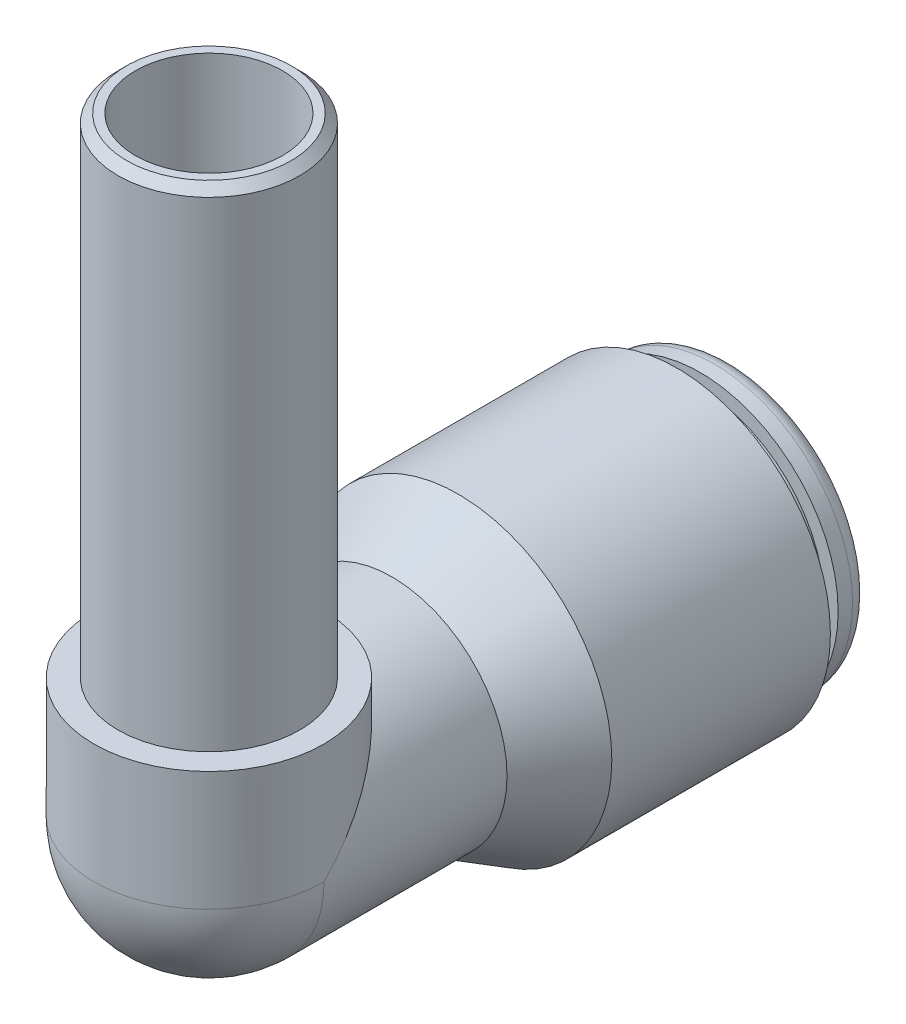
ISO-10303-21;
HEADER;
FILE_DESCRIPTION(('STEP AP214'),'2;1');
FILE_NAME('part.step','',(''),(''),'','','');
FILE_SCHEMA(('AUTOMOTIVE_DESIGN { 1 0 10303 214 1 1 1 1 }'));
ENDSEC;
DATA;
#1=APPLICATION_CONTEXT('core data for automotive mechanical design processes');
#2=APPLICATION_PROTOCOL_DEFINITION('international standard','automotive_design',2000,#1);
#3=PRODUCT_CONTEXT('',#1,'mechanical');
#4=PRODUCT('Part','Part','',(#3));
#5=PRODUCT_RELATED_PRODUCT_CATEGORY('part','',(#4));
#6=PRODUCT_DEFINITION_FORMATION('','',#4);
#7=PRODUCT_DEFINITION_CONTEXT('part definition',#1,'design');
#8=PRODUCT_DEFINITION('design','',#6,#7);
#9=PRODUCT_DEFINITION_SHAPE('','',#8);
#10=(LENGTH_UNIT() NAMED_UNIT(*) SI_UNIT(.MILLI.,.METRE.));
#11=(NAMED_UNIT(*) PLANE_ANGLE_UNIT() SI_UNIT($,.RADIAN.));
#12=(NAMED_UNIT(*) SI_UNIT($,.STERADIAN.) SOLID_ANGLE_UNIT());
#13=UNCERTAINTY_MEASURE_WITH_UNIT(LENGTH_MEASURE(1.E-05),#10,'distance_accuracy_value','');
#14=(GEOMETRIC_REPRESENTATION_CONTEXT(3) GLOBAL_UNCERTAINTY_ASSIGNED_CONTEXT((#13)) GLOBAL_UNIT_ASSIGNED_CONTEXT((#10,
#11,#12)) REPRESENTATION_CONTEXT('',''));
#15=CARTESIAN_POINT('',(0.,0.,0.));
#16=DIRECTION('',(0.,0.,1.));
#17=DIRECTION('',(1.,0.,0.));
#18=AXIS2_PLACEMENT_3D('',#15,#16,#17);
#19=CARTESIAN_POINT('',(0.,5.25,0.));
#20=DIRECTION('',(0.,1.,0.));
#21=DIRECTION('',(0.,0.,1.));
#22=AXIS2_PLACEMENT_3D('',#19,#20,#21);
#23=PLANE('',#22);
#24=CARTESIAN_POINT('',(0.,5.25,0.));
#25=DIRECTION('',(0.,1.,0.));
#26=DIRECTION('',(0.,0.,1.));
#27=AXIS2_PLACEMENT_3D('',#24,#25,#26);
#28=CIRCLE('',#27,5.0625);
#29=CARTESIAN_POINT('',(0.,5.25000000000002,5.06249999999998));
#30=VERTEX_POINT('',#29);
#31=EDGE_CURVE('E106',#30,#30,#28,.T.);
#32=ORIENTED_EDGE('',*,*,#31,.T.);
#33=EDGE_LOOP('',(#32));
#34=FACE_BOUND('',#33,.T.);
#35=CARTESIAN_POINT('',(0.,5.25,0.));
#36=DIRECTION('',(0.,1.,0.));
#37=DIRECTION('',(0.,0.,1.));
#38=AXIS2_PLACEMENT_3D('',#35,#36,#37);
#39=CIRCLE('',#38,4.);
#40=CARTESIAN_POINT('',(0.,5.25000000000001,3.99999999999998));
#41=VERTEX_POINT('',#40);
#42=EDGE_CURVE('E79',#41,#41,#39,.T.);
#43=ORIENTED_EDGE('',*,*,#42,.F.);
#44=EDGE_LOOP('',(#43));
#45=FACE_BOUND('',#44,.T.);
#46=ADVANCED_FACE('F43',(#34,#45),#23,.T.);
#47=CARTESIAN_POINT('',(0.,5.25,0.));
#48=DIRECTION('',(0.,-1.,0.));
#49=DIRECTION('',(0.,0.,-1.));
#50=AXIS2_PLACEMENT_3D('',#47,#48,#49);
#51=CYLINDRICAL_SURFACE('',#50,3.238);
#52=CARTESIAN_POINT('',(0.,0.,0.));
#53=DIRECTION('',(0.,-0.707106781186549,-0.707106781186546));
#54=DIRECTION('',(0.,-0.707106781186546,0.707106781186549));
#55=AXIS2_PLACEMENT_3D('',#52,#53,#54);
#56=ELLIPSE('',#55,4.57922351496409,3.238);
#57=CARTESIAN_POINT('',(3.238,0.,0.));
#58=VERTEX_POINT('',#57);
#59=CARTESIAN_POINT('',(-3.238,0.,0.));
#60=VERTEX_POINT('',#59);
#61=EDGE_CURVE('E70',#58,#60,#56,.F.);
#62=ORIENTED_EDGE('',*,*,#61,.F.);
#63=CARTESIAN_POINT('',(0.,0.,0.));
#64=DIRECTION('',(0.,-1.,0.));
#65=DIRECTION('',(1.,0.,0.));
#66=AXIS2_PLACEMENT_3D('',#63,#64,#65);
#67=CIRCLE('',#66,3.238);
#68=EDGE_CURVE('E75',#58,#60,#67,.T.);
#69=ORIENTED_EDGE('',*,*,#68,.T.);
#70=EDGE_LOOP('',(#62,#69));
#71=FACE_BOUND('',#70,.T.);
#72=CARTESIAN_POINT('',(0.,26.75,0.));
#73=DIRECTION('',(0.,1.,0.));
#74=DIRECTION('',(0.,0.,1.));
#75=AXIS2_PLACEMENT_3D('',#72,#73,#74);
#76=CIRCLE('',#75,3.238);
#77=CARTESIAN_POINT('',(0.,26.75,3.23799999999991));
#78=VERTEX_POINT('',#77);
#79=EDGE_CURVE('E169',#78,#78,#76,.T.);
#80=ORIENTED_EDGE('',*,*,#79,.T.);
#81=EDGE_LOOP('',(#80));
#82=FACE_BOUND('',#81,.T.);
#83=ADVANCED_FACE('F72',(#71,#82),#51,.F.);
#84=CARTESIAN_POINT('',(0.,0.,0.));
#85=DIRECTION('',(0.,0.,1.));
#86=DIRECTION('',(1.,0.,0.));
#87=AXIS2_PLACEMENT_3D('',#84,#85,#86);
#88=CYLINDRICAL_SURFACE('',#87,4.);
#89=CARTESIAN_POINT('',(0.,0.,-22.619));
#90=DIRECTION('',(0.,0.,1.));
#91=DIRECTION('',(1.,0.,0.));
#92=AXIS2_PLACEMENT_3D('',#89,#90,#91);
#93=CIRCLE('',#92,4.);
#94=CARTESIAN_POINT('',(4.,0.,-22.619));
#95=VERTEX_POINT('',#94);
#96=EDGE_CURVE('E95',#95,#95,#93,.T.);
#97=ORIENTED_EDGE('',*,*,#96,.F.);
#98=EDGE_LOOP('',(#97));
#99=FACE_BOUND('',#98,.T.);
#100=CARTESIAN_POINT('',(0.,0.,-5.0625));
#101=DIRECTION('',(0.,0.,1.));
#102=DIRECTION('',(1.,0.,0.));
#103=AXIS2_PLACEMENT_3D('',#100,#101,#102);
#104=CIRCLE('',#103,4.);
#105=CARTESIAN_POINT('',(4.,0.,-5.0625));
#106=VERTEX_POINT('',#105);
#107=EDGE_CURVE('E112',#106,#106,#104,.F.);
#108=ORIENTED_EDGE('',*,*,#107,.F.);
#109=EDGE_LOOP('',(#108));
#110=FACE_BOUND('',#109,.T.);
#111=ADVANCED_FACE('F186',(#99,#110),#88,.F.);
#112=CARTESIAN_POINT('',(0.,0.,0.));
#113=DIRECTION('',(0.,0.,1.));
#114=DIRECTION('',(1.,0.,0.));
#115=AXIS2_PLACEMENT_3D('',#112,#113,#114);
#116=CYLINDRICAL_SURFACE('',#115,5.0625);
#117=CARTESIAN_POINT('',(0.,0.,0.));
#118=DIRECTION('',(0.,0.,1.));
#119=DIRECTION('',(1.,0.,0.));
#120=AXIS2_PLACEMENT_3D('',#117,#118,#119);
#121=CIRCLE('',#120,5.0625);
#122=CARTESIAN_POINT('',(-5.0625,0.,0.));
#123=VERTEX_POINT('',#122);
#124=CARTESIAN_POINT('',(5.0625,0.,0.));
#125=VERTEX_POINT('',#124);
#126=EDGE_CURVE('E58',#123,#125,#121,.T.);
#127=ORIENTED_EDGE('',*,*,#126,.F.);
#128=CARTESIAN_POINT('',(0.,0.,0.));
#129=DIRECTION('',(0.,0.707106781186549,0.707106781186546));
#130=DIRECTION('',(0.,-0.707106781186546,0.707106781186549));
#131=AXIS2_PLACEMENT_3D('',#128,#129,#130);
#132=ELLIPSE('',#131,7.1594561595138,5.0625);
#133=EDGE_CURVE('E62',#123,#125,#132,.F.);
#134=ORIENTED_EDGE('',*,*,#133,.T.);
#135=EDGE_LOOP('',(#127,#134));
#136=FACE_BOUND('',#135,.T.);
#137=CARTESIAN_POINT('',(0.,0.,-8.05));
#138=DIRECTION('',(0.,0.,1.));
#139=DIRECTION('',(1.,0.,0.));
#140=AXIS2_PLACEMENT_3D('',#137,#138,#139);
#141=CIRCLE('',#140,5.0625);
#142=CARTESIAN_POINT('',(5.0625,0.,-8.05));
#143=VERTEX_POINT('',#142);
#144=EDGE_CURVE('E117',#143,#143,#141,.T.);
#145=ORIENTED_EDGE('',*,*,#144,.T.);
#146=EDGE_LOOP('',(#145));
#147=FACE_BOUND('',#146,.T.);
#148=ADVANCED_FACE('F240',(#136,#147),#116,.T.);
#149=CARTESIAN_POINT('',(0.,0.,-10.9728357377725));
#150=DIRECTION('',(0.,0.,-1.));
#151=DIRECTION('',(-1.,0.,0.));
#152=AXIS2_PLACEMENT_3D('',#149,#150,#151);
#153=CONICAL_SURFACE('',#152,6.75,0.5235987755983);
#154=ORIENTED_EDGE('',*,*,#144,.F.);
#155=EDGE_LOOP('',(#154));
#156=FACE_BOUND('',#155,.T.);
#157=CARTESIAN_POINT('',(0.,0.,-10.9728357377725));
#158=DIRECTION('',(0.,0.,1.));
#159=DIRECTION('',(1.,0.,0.));
#160=AXIS2_PLACEMENT_3D('',#157,#158,#159);
#161=CIRCLE('',#160,6.75);
#162=CARTESIAN_POINT('',(6.75,0.,-10.9728357377725));
#163=VERTEX_POINT('',#162);
#164=EDGE_CURVE('E123',#163,#163,#161,.T.);
#165=ORIENTED_EDGE('',*,*,#164,.T.);
#166=EDGE_LOOP('',(#165));
#167=FACE_BOUND('',#166,.T.);
#168=ADVANCED_FACE('F236',(#156,#167),#153,.T.);
#169=CARTESIAN_POINT('',(0.,0.,0.));
#170=DIRECTION('',(0.,0.,1.));
#171=DIRECTION('',(1.,0.,0.));
#172=AXIS2_PLACEMENT_3D('',#169,#170,#171);
#173=CYLINDRICAL_SURFACE('',#172,6.75);
#174=ORIENTED_EDGE('',*,*,#164,.F.);
#175=EDGE_LOOP('',(#174));
#176=FACE_BOUND('',#175,.T.);
#177=CARTESIAN_POINT('',(0.,0.,-20.587));
#178=DIRECTION('',(0.,0.,1.));
#179=DIRECTION('',(1.,0.,0.));
#180=AXIS2_PLACEMENT_3D('',#177,#178,#179);
#181=CIRCLE('',#180,6.75);
#182=CARTESIAN_POINT('',(6.75,0.,-20.587));
#183=VERTEX_POINT('',#182);
#184=EDGE_CURVE('E129',#183,#183,#181,.T.);
#185=ORIENTED_EDGE('',*,*,#184,.T.);
#186=EDGE_LOOP('',(#185));
#187=FACE_BOUND('',#186,.T.);
#188=ADVANCED_FACE('F232',(#176,#187),#173,.T.);
#189=CARTESIAN_POINT('',(0.,6.75,-20.587));
#190=DIRECTION('',(0.,0.,1.));
#191=DIRECTION('',(1.,0.,0.));
#192=AXIS2_PLACEMENT_3D('',#189,#190,#191);
#193=PLANE('',#192);
#194=ORIENTED_EDGE('',*,*,#184,.F.);
#195=EDGE_LOOP('',(#194));
#196=FACE_BOUND('',#195,.T.);
#197=CARTESIAN_POINT('',(0.,0.,-20.587));
#198=DIRECTION('',(0.,0.,1.));
#199=DIRECTION('',(1.,0.,0.));
#200=AXIS2_PLACEMENT_3D('',#197,#198,#199);
#201=CIRCLE('',#200,5.4675);
#202=CARTESIAN_POINT('',(5.4675,0.,-20.587));
#203=VERTEX_POINT('',#202);
#204=EDGE_CURVE('E133',#203,#203,#201,.T.);
#205=ORIENTED_EDGE('',*,*,#204,.T.);
#206=EDGE_LOOP('',(#205));
#207=FACE_BOUND('',#206,.T.);
#208=ADVANCED_FACE('F228',(#196,#207),#193,.F.);
#209=CARTESIAN_POINT('',(0.,0.,0.));
#210=DIRECTION('',(0.,0.,1.));
#211=DIRECTION('',(1.,0.,0.));
#212=AXIS2_PLACEMENT_3D('',#209,#210,#211);
#213=CYLINDRICAL_SURFACE('',#212,5.4675);
#214=ORIENTED_EDGE('',*,*,#204,.F.);
#215=EDGE_LOOP('',(#214));
#216=FACE_BOUND('',#215,.T.);
#217=CARTESIAN_POINT('',(0.,0.,-21.603));
#218=DIRECTION('',(0.,0.,1.));
#219=DIRECTION('',(1.,0.,0.));
#220=AXIS2_PLACEMENT_3D('',#217,#218,#219);
#221=CIRCLE('',#220,5.4675);
#222=CARTESIAN_POINT('',(5.4675,0.,-21.603));
#223=VERTEX_POINT('',#222);
#224=EDGE_CURVE('E137',#223,#223,#221,.T.);
#225=ORIENTED_EDGE('',*,*,#224,.T.);
#226=EDGE_LOOP('',(#225));
#227=FACE_BOUND('',#226,.T.);
#228=ADVANCED_FACE('F224',(#216,#227),#213,.T.);
#229=CARTESIAN_POINT('',(0.,6.075,-21.603));
#230=DIRECTION('',(0.,0.,-1.));
#231=DIRECTION('',(-1.,0.,0.));
#232=AXIS2_PLACEMENT_3D('',#229,#230,#231);
#233=PLANE('',#232);
#234=ORIENTED_EDGE('',*,*,#224,.F.);
#235=EDGE_LOOP('',(#234));
#236=FACE_BOUND('',#235,.T.);
#237=CARTESIAN_POINT('',(0.,0.,-21.603));
#238=DIRECTION('',(0.,0.,1.));
#239=DIRECTION('',(1.,0.,0.));
#240=AXIS2_PLACEMENT_3D('',#237,#238,#239);
#241=CIRCLE('',#240,6.075);
#242=CARTESIAN_POINT('',(6.075,0.,-21.603));
#243=VERTEX_POINT('',#242);
#244=EDGE_CURVE('E141',#243,#243,#241,.T.);
#245=ORIENTED_EDGE('',*,*,#244,.T.);
#246=EDGE_LOOP('',(#245));
#247=FACE_BOUND('',#246,.T.);
#248=ADVANCED_FACE('F220',(#236,#247),#233,.F.);
#249=CARTESIAN_POINT('',(0.,0.,0.));
#250=DIRECTION('',(0.,0.,1.));
#251=DIRECTION('',(1.,0.,0.));
#252=AXIS2_PLACEMENT_3D('',#249,#250,#251);
#253=CYLINDRICAL_SURFACE('',#252,6.075);
#254=ORIENTED_EDGE('',*,*,#244,.F.);
#255=EDGE_LOOP('',(#254));
#256=FACE_BOUND('',#255,.T.);
#257=CARTESIAN_POINT('',(0.,0.,-22.238));
#258=DIRECTION('',(0.,0.,1.));
#259=DIRECTION('',(1.,0.,0.));
#260=AXIS2_PLACEMENT_3D('',#257,#258,#259);
#261=CIRCLE('',#260,6.075);
#262=CARTESIAN_POINT('',(6.075,0.,-22.238));
#263=VERTEX_POINT('',#262);
#264=EDGE_CURVE('E145',#263,#263,#261,.T.);
#265=ORIENTED_EDGE('',*,*,#264,.T.);
#266=EDGE_LOOP('',(#265));
#267=FACE_BOUND('',#266,.T.);
#268=ADVANCED_FACE('F216',(#256,#267),#253,.T.);
#269=CARTESIAN_POINT('',(0.,0.,-22.238));
#270=DIRECTION('',(0.,0.,1.));
#271=DIRECTION('',(1.,0.,0.));
#272=AXIS2_PLACEMENT_3D('',#269,#270,#271);
#273=TOROIDAL_SURFACE('',#272,5.313,0.761999999999999);
#274=ORIENTED_EDGE('',*,*,#264,.F.);
#275=EDGE_LOOP('',(#274));
#276=FACE_BOUND('',#275,.T.);
#277=CARTESIAN_POINT('',(0.,0.,-23.));
#278=DIRECTION('',(0.,0.,1.));
#279=DIRECTION('',(1.,0.,0.));
#280=AXIS2_PLACEMENT_3D('',#277,#278,#279);
#281=CIRCLE('',#280,5.313);
#282=CARTESIAN_POINT('',(5.313,0.,-23.));
#283=VERTEX_POINT('',#282);
#284=EDGE_CURVE('E149',#283,#283,#281,.T.);
#285=ORIENTED_EDGE('',*,*,#284,.T.);
#286=EDGE_LOOP('',(#285));
#287=FACE_BOUND('',#286,.T.);
#288=ADVANCED_FACE('F212',(#276,#287),#273,.T.);
#289=CARTESIAN_POINT('',(0.,5.313,-23.));
#290=DIRECTION('',(0.,0.,1.));
#291=DIRECTION('',(1.,0.,0.));
#292=AXIS2_PLACEMENT_3D('',#289,#290,#291);
#293=PLANE('',#292);
#294=ORIENTED_EDGE('',*,*,#284,.F.);
#295=EDGE_LOOP('',(#294));
#296=FACE_BOUND('',#295,.T.);
#297=CARTESIAN_POINT('',(0.,0.,-23.));
#298=DIRECTION('',(0.,0.,1.));
#299=DIRECTION('',(1.,0.,0.));
#300=AXIS2_PLACEMENT_3D('',#297,#298,#299);
#301=CIRCLE('',#300,4.381);
#302=CARTESIAN_POINT('',(4.381,0.,-23.));
#303=VERTEX_POINT('',#302);
#304=EDGE_CURVE('E153',#303,#303,#301,.T.);
#305=ORIENTED_EDGE('',*,*,#304,.T.);
#306=EDGE_LOOP('',(#305));
#307=FACE_BOUND('',#306,.T.);
#308=ADVANCED_FACE('F208',(#296,#307),#293,.F.);
#309=CARTESIAN_POINT('',(0.,0.,-22.619));
#310=DIRECTION('',(0.,0.,-1.));
#311=DIRECTION('',(-1.,0.,0.));
#312=AXIS2_PLACEMENT_3D('',#309,#310,#311);
#313=CONICAL_SURFACE('',#312,4.,0.78539816339745);
#314=ORIENTED_EDGE('',*,*,#304,.F.);
#315=EDGE_LOOP('',(#314));
#316=FACE_BOUND('',#315,.T.);
#317=ORIENTED_EDGE('',*,*,#96,.T.);
#318=EDGE_LOOP('',(#317));
#319=FACE_BOUND('',#318,.T.);
#320=ADVANCED_FACE('F205',(#316,#319),#313,.F.);
#321=CARTESIAN_POINT('',(0.,0.,-5.0625));
#322=DIRECTION('',(0.,0.,1.));
#323=DIRECTION('',(1.,0.,0.));
#324=AXIS2_PLACEMENT_3D('',#321,#322,#323);
#325=PLANE('',#324);
#326=ORIENTED_EDGE('',*,*,#107,.T.);
#327=EDGE_LOOP('',(#326));
#328=FACE_BOUND('',#327,.T.);
#329=CARTESIAN_POINT('',(0.,0.,-5.0625));
#330=DIRECTION('',(0.,0.,1.));
#331=DIRECTION('',(1.,0.,0.));
#332=AXIS2_PLACEMENT_3D('',#329,#330,#331);
#333=CIRCLE('',#332,3.238);
#334=CARTESIAN_POINT('',(3.238,0.,-5.0625));
#335=VERTEX_POINT('',#334);
#336=EDGE_CURVE('E90',#335,#335,#333,.T.);
#337=ORIENTED_EDGE('',*,*,#336,.T.);
#338=EDGE_LOOP('',(#337));
#339=FACE_BOUND('',#338,.T.);
#340=ADVANCED_FACE('F202',(#328,#339),#325,.F.);
#341=CARTESIAN_POINT('',(0.,0.,-5.0625));
#342=DIRECTION('',(0.,0.,1.));
#343=DIRECTION('',(1.,0.,0.));
#344=AXIS2_PLACEMENT_3D('',#341,#342,#343);
#345=CYLINDRICAL_SURFACE('',#344,3.238);
#346=CARTESIAN_POINT('',(0.,0.,0.));
#347=DIRECTION('',(0.,0.,-1.));
#348=DIRECTION('',(1.,0.,0.));
#349=AXIS2_PLACEMENT_3D('',#346,#347,#348);
#350=CIRCLE('',#349,3.238);
#351=EDGE_CURVE('E81',#58,#60,#350,.T.);
#352=ORIENTED_EDGE('',*,*,#351,.F.);
#353=ORIENTED_EDGE('',*,*,#61,.T.);
#354=EDGE_LOOP('',(#352,#353));
#355=FACE_BOUND('',#354,.T.);
#356=ORIENTED_EDGE('',*,*,#336,.F.);
#357=EDGE_LOOP('',(#356));
#358=FACE_BOUND('',#357,.T.);
#359=ADVANCED_FACE('F82',(#355,#358),#345,.F.);
#360=CARTESIAN_POINT('',(0.,0.,0.));
#361=DIRECTION('',(1.,0.,0.));
#362=DIRECTION('',(0.,0.,-1.));
#363=AXIS2_PLACEMENT_3D('',#360,#361,#362);
#364=SPHERICAL_SURFACE('',#363,5.0625);
#365=ORIENTED_EDGE('',*,*,#126,.T.);
#366=CARTESIAN_POINT('',(0.,0.,0.));
#367=DIRECTION('',(0.,1.,0.));
#368=DIRECTION('',(1.,0.,0.));
#369=AXIS2_PLACEMENT_3D('',#366,#367,#368);
#370=CIRCLE('',#369,5.0625);
#371=EDGE_CURVE('E86',#123,#125,#370,.T.);
#372=ORIENTED_EDGE('',*,*,#371,.F.);
#373=EDGE_LOOP('',(#365,#372));
#374=FACE_BOUND('',#373,.T.);
#375=ADVANCED_FACE('F195',(#374),#364,.T.);
#376=CARTESIAN_POINT('',(0.,0.,0.));
#377=DIRECTION('',(1.,0.,0.));
#378=DIRECTION('',(0.,0.,1.));
#379=AXIS2_PLACEMENT_3D('',#376,#377,#378);
#380=SPHERICAL_SURFACE('',#379,3.238);
#381=ORIENTED_EDGE('',*,*,#351,.T.);
#382=ORIENTED_EDGE('',*,*,#68,.F.);
#383=EDGE_LOOP('',(#381,#382));
#384=FACE_BOUND('',#383,.T.);
#385=ADVANCED_FACE('F88',(#384),#380,.F.);
#386=CARTESIAN_POINT('',(0.,5.25,0.));
#387=DIRECTION('',(0.,-1.,0.));
#388=DIRECTION('',(0.,0.,-1.));
#389=AXIS2_PLACEMENT_3D('',#386,#387,#388);
#390=CYLINDRICAL_SURFACE('',#389,5.0625);
#391=ORIENTED_EDGE('',*,*,#371,.T.);
#392=ORIENTED_EDGE('',*,*,#133,.F.);
#393=EDGE_LOOP('',(#391,#392));
#394=FACE_BOUND('',#393,.T.);
#395=ORIENTED_EDGE('',*,*,#31,.F.);
#396=EDGE_LOOP('',(#395));
#397=FACE_BOUND('',#396,.T.);
#398=ADVANCED_FACE('F191',(#394,#397),#390,.T.);
#399=CARTESIAN_POINT('',(0.,38.0637084989847,-1.3289872791137E-13));
#400=DIRECTION('',(0.,-1.,0.));
#401=DIRECTION('',(0.,0.,-1.));
#402=AXIS2_PLACEMENT_3D('',#399,#400,#401);
#403=CYLINDRICAL_SURFACE('',#402,4.);
#404=CARTESIAN_POINT('',(0.,26.369,0.));
#405=DIRECTION('',(0.,1.,0.));
#406=DIRECTION('',(0.,0.,1.));
#407=AXIS2_PLACEMENT_3D('',#404,#405,#406);
#408=CIRCLE('',#407,4.);
#409=CARTESIAN_POINT('',(0.,26.369,3.99999999999991));
#410=VERTEX_POINT('',#409);
#411=EDGE_CURVE('E11',#410,#410,#408,.F.);
#412=ORIENTED_EDGE('',*,*,#411,.T.);
#413=EDGE_LOOP('',(#412));
#414=FACE_BOUND('',#413,.T.);
#415=ORIENTED_EDGE('',*,*,#42,.T.);
#416=EDGE_LOOP('',(#415));
#417=FACE_BOUND('',#416,.T.);
#418=ADVANCED_FACE('F177',(#414,#417),#403,.T.);
#419=CARTESIAN_POINT('',(0.,26.75,0.));
#420=DIRECTION('',(0.,1.,0.));
#421=DIRECTION('',(0.,0.,1.));
#422=AXIS2_PLACEMENT_3D('',#419,#420,#421);
#423=PLANE('',#422);
#424=CARTESIAN_POINT('',(0.,26.75,0.));
#425=DIRECTION('',(0.,1.,0.));
#426=DIRECTION('',(0.,0.,1.));
#427=AXIS2_PLACEMENT_3D('',#424,#425,#426);
#428=CIRCLE('',#427,3.61900000000002);
#429=CARTESIAN_POINT('',(0.,26.75,3.61899999999992));
#430=VERTEX_POINT('',#429);
#431=EDGE_CURVE('E52',#430,#430,#428,.T.);
#432=ORIENTED_EDGE('',*,*,#431,.T.);
#433=EDGE_LOOP('',(#432));
#434=FACE_BOUND('',#433,.T.);
#435=ORIENTED_EDGE('',*,*,#79,.F.);
#436=EDGE_LOOP('',(#435));
#437=FACE_BOUND('',#436,.T.);
#438=ADVANCED_FACE('F304',(#434,#437),#423,.T.);
#439=CARTESIAN_POINT('',(0.,26.75,0.));
#440=DIRECTION('',(0.,-1.,0.));
#441=DIRECTION('',(0.,0.,-1.));
#442=AXIS2_PLACEMENT_3D('',#439,#440,#441);
#443=CONICAL_SURFACE('',#442,3.619,0.785398163397455);
#444=ORIENTED_EDGE('',*,*,#411,.F.);
#445=EDGE_LOOP('',(#444));
#446=FACE_BOUND('',#445,.T.);
#447=ORIENTED_EDGE('',*,*,#431,.F.);
#448=EDGE_LOOP('',(#447));
#449=FACE_BOUND('',#448,.T.);
#450=ADVANCED_FACE('F45',(#446,#449),#443,.T.);
#451=CLOSED_SHELL('',(#46,#83,#111,#148,#168,#188,#208,#228,#248,#268,#288,#308,#320,#340,#359,
#375,#385,#398,#418,#438,#450));
#452=MANIFOLD_SOLID_BREP('B2',#451);
#453=ADVANCED_BREP_SHAPE_REPRESENTATION('',(#18,#452),#14);
#454=SHAPE_DEFINITION_REPRESENTATION(#9,#453);
ENDSEC;
END-ISO-10303-21;
